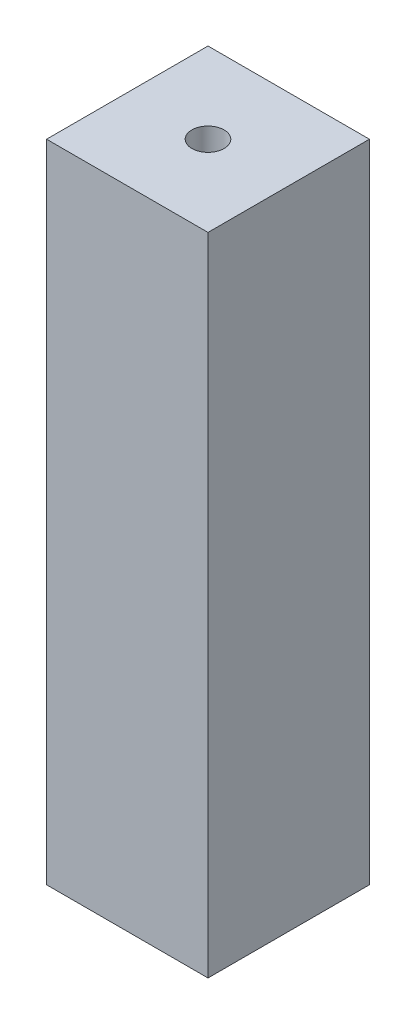
ISO-10303-21;
HEADER;
FILE_DESCRIPTION(('STEP AP214'),'2;1');
FILE_NAME('part.step','',(''),(''),'','','');
FILE_SCHEMA(('AUTOMOTIVE_DESIGN { 1 0 10303 214 1 1 1 1 }'));
ENDSEC;
DATA;
#1=APPLICATION_CONTEXT('core data for automotive mechanical design processes');
#2=APPLICATION_PROTOCOL_DEFINITION('international standard','automotive_design',2000,#1);
#3=PRODUCT_CONTEXT('',#1,'mechanical');
#4=PRODUCT('Part','Part','',(#3));
#5=PRODUCT_RELATED_PRODUCT_CATEGORY('part','',(#4));
#6=PRODUCT_DEFINITION_FORMATION('','',#4);
#7=PRODUCT_DEFINITION_CONTEXT('part definition',#1,'design');
#8=PRODUCT_DEFINITION('design','',#6,#7);
#9=PRODUCT_DEFINITION_SHAPE('','',#8);
#10=(LENGTH_UNIT() NAMED_UNIT(*) SI_UNIT(.MILLI.,.METRE.));
#11=(NAMED_UNIT(*) PLANE_ANGLE_UNIT() SI_UNIT($,.RADIAN.));
#12=(NAMED_UNIT(*) SI_UNIT($,.STERADIAN.) SOLID_ANGLE_UNIT());
#13=UNCERTAINTY_MEASURE_WITH_UNIT(LENGTH_MEASURE(1.E-05),#10,'distance_accuracy_value','');
#14=(GEOMETRIC_REPRESENTATION_CONTEXT(3) GLOBAL_UNCERTAINTY_ASSIGNED_CONTEXT((#13)) GLOBAL_UNIT_ASSIGNED_CONTEXT((#10,
#11,#12)) REPRESENTATION_CONTEXT('',''));
#15=CARTESIAN_POINT('',(0.,0.,0.));
#16=DIRECTION('',(0.,0.,1.));
#17=DIRECTION('',(1.,0.,0.));
#18=AXIS2_PLACEMENT_3D('',#15,#16,#17);
#19=CARTESIAN_POINT('',(0.,60.,0.));
#20=DIRECTION('',(0.,1.,0.));
#21=DIRECTION('',(0.,0.,1.));
#22=AXIS2_PLACEMENT_3D('',#19,#20,#21);
#23=PLANE('',#22);
#24=DIRECTION('',(0.,0.,1.));
#25=VECTOR('',#24,1.);
#26=CARTESIAN_POINT('',(-7.5,60.,-7.5));
#27=LINE('',#26,#25);
#28=CARTESIAN_POINT('',(-7.5,60.,-7.5));
#29=VERTEX_POINT('',#28);
#30=CARTESIAN_POINT('',(-7.5,60.,7.5));
#31=VERTEX_POINT('',#30);
#32=EDGE_CURVE('E98',#29,#31,#27,.T.);
#33=ORIENTED_EDGE('',*,*,#32,.T.);
#34=DIRECTION('',(1.,0.,0.));
#35=VECTOR('',#34,1.);
#36=CARTESIAN_POINT('',(-7.5,60.,7.5));
#37=LINE('',#36,#35);
#38=CARTESIAN_POINT('',(7.5,60.,7.5));
#39=VERTEX_POINT('',#38);
#40=EDGE_CURVE('E93',#31,#39,#37,.T.);
#41=ORIENTED_EDGE('',*,*,#40,.T.);
#42=DIRECTION('',(0.,0.,-1.));
#43=VECTOR('',#42,1.);
#44=CARTESIAN_POINT('',(7.5,60.,-7.5));
#45=LINE('',#44,#43);
#46=CARTESIAN_POINT('',(7.5,60.,-7.5));
#47=VERTEX_POINT('',#46);
#48=EDGE_CURVE('E96',#39,#47,#45,.T.);
#49=ORIENTED_EDGE('',*,*,#48,.T.);
#50=DIRECTION('',(-1.,0.,0.));
#51=VECTOR('',#50,1.);
#52=CARTESIAN_POINT('',(-7.5,60.,-7.5));
#53=LINE('',#52,#51);
#54=EDGE_CURVE('E63',#47,#29,#53,.T.);
#55=ORIENTED_EDGE('',*,*,#54,.T.);
#56=EDGE_LOOP('',(#33,#41,#49,#55));
#57=FACE_BOUND('',#56,.T.);
#58=CARTESIAN_POINT('',(0.,60.,0.));
#59=DIRECTION('',(0.,1.,0.));
#60=DIRECTION('',(0.,0.,1.));
#61=AXIS2_PLACEMENT_3D('',#58,#59,#60);
#62=CIRCLE('',#61,1.5);
#63=CARTESIAN_POINT('',(0.,60.,1.5));
#64=VERTEX_POINT('',#63);
#65=EDGE_CURVE('E118',#64,#64,#62,.T.);
#66=ORIENTED_EDGE('',*,*,#65,.F.);
#67=EDGE_LOOP('',(#66));
#68=FACE_BOUND('',#67,.T.);
#69=ADVANCED_FACE('F45',(#57,#68),#23,.T.);
#70=CARTESIAN_POINT('',(0.,0.,0.));
#71=DIRECTION('',(0.,1.,0.));
#72=DIRECTION('',(0.,0.,1.));
#73=AXIS2_PLACEMENT_3D('',#70,#71,#72);
#74=PLANE('',#73);
#75=DIRECTION('',(0.,0.,1.));
#76=VECTOR('',#75,1.);
#77=CARTESIAN_POINT('',(-7.5,0.,-7.5));
#78=LINE('',#77,#76);
#79=CARTESIAN_POINT('',(-7.5,0.,-7.5));
#80=VERTEX_POINT('',#79);
#81=CARTESIAN_POINT('',(-7.5,0.,7.5));
#82=VERTEX_POINT('',#81);
#83=EDGE_CURVE('E114',#80,#82,#78,.T.);
#84=ORIENTED_EDGE('',*,*,#83,.F.);
#85=DIRECTION('',(-1.,0.,0.));
#86=VECTOR('',#85,1.);
#87=CARTESIAN_POINT('',(-7.5,0.,-7.5));
#88=LINE('',#87,#86);
#89=CARTESIAN_POINT('',(7.5,0.,-7.5));
#90=VERTEX_POINT('',#89);
#91=EDGE_CURVE('E86',#90,#80,#88,.T.);
#92=ORIENTED_EDGE('',*,*,#91,.F.);
#93=DIRECTION('',(0.,0.,-1.));
#94=VECTOR('',#93,1.);
#95=CARTESIAN_POINT('',(7.5,0.,-7.5));
#96=LINE('',#95,#94);
#97=CARTESIAN_POINT('',(7.5,0.,7.5));
#98=VERTEX_POINT('',#97);
#99=EDGE_CURVE('E80',#98,#90,#96,.T.);
#100=ORIENTED_EDGE('',*,*,#99,.F.);
#101=DIRECTION('',(1.,0.,0.));
#102=VECTOR('',#101,1.);
#103=CARTESIAN_POINT('',(-7.5,0.,7.5));
#104=LINE('',#103,#102);
#105=EDGE_CURVE('E103',#82,#98,#104,.T.);
#106=ORIENTED_EDGE('',*,*,#105,.F.);
#107=EDGE_LOOP('',(#84,#92,#100,#106));
#108=FACE_BOUND('',#107,.T.);
#109=CARTESIAN_POINT('',(0.,0.,0.));
#110=DIRECTION('',(0.,1.,0.));
#111=DIRECTION('',(0.,0.,1.));
#112=AXIS2_PLACEMENT_3D('',#109,#110,#111);
#113=CIRCLE('',#112,1.5);
#114=CARTESIAN_POINT('',(0.,0.,1.5));
#115=VERTEX_POINT('',#114);
#116=EDGE_CURVE('E136',#115,#115,#113,.T.);
#117=ORIENTED_EDGE('',*,*,#116,.T.);
#118=EDGE_LOOP('',(#117));
#119=FACE_BOUND('',#118,.T.);
#120=ADVANCED_FACE('F131',(#108,#119),#74,.F.);
#121=CARTESIAN_POINT('',(-7.5,60.,-7.5));
#122=DIRECTION('',(1.,0.,0.));
#123=DIRECTION('',(0.,0.,-1.));
#124=AXIS2_PLACEMENT_3D('',#121,#122,#123);
#125=PLANE('',#124);
#126=ORIENTED_EDGE('',*,*,#83,.T.);
#127=DIRECTION('',(0.,-1.,0.));
#128=VECTOR('',#127,1.);
#129=CARTESIAN_POINT('',(-7.5,60.,7.5));
#130=LINE('',#129,#128);
#131=EDGE_CURVE('E11',#31,#82,#130,.T.);
#132=ORIENTED_EDGE('',*,*,#131,.F.);
#133=ORIENTED_EDGE('',*,*,#32,.F.);
#134=DIRECTION('',(0.,-1.,0.));
#135=VECTOR('',#134,1.);
#136=CARTESIAN_POINT('',(-7.5,60.,-7.5));
#137=LINE('',#136,#135);
#138=EDGE_CURVE('E110',#29,#80,#137,.T.);
#139=ORIENTED_EDGE('',*,*,#138,.T.);
#140=EDGE_LOOP('',(#126,#132,#133,#139));
#141=FACE_BOUND('',#140,.T.);
#142=ADVANCED_FACE('F47',(#141),#125,.F.);
#143=CARTESIAN_POINT('',(-7.5,60.,7.5));
#144=DIRECTION('',(0.,0.,-1.));
#145=DIRECTION('',(-1.,0.,0.));
#146=AXIS2_PLACEMENT_3D('',#143,#144,#145);
#147=PLANE('',#146);
#148=ORIENTED_EDGE('',*,*,#105,.T.);
#149=DIRECTION('',(0.,-1.,0.));
#150=VECTOR('',#149,1.);
#151=CARTESIAN_POINT('',(7.5,60.,7.5));
#152=LINE('',#151,#150);
#153=EDGE_CURVE('E55',#39,#98,#152,.T.);
#154=ORIENTED_EDGE('',*,*,#153,.F.);
#155=ORIENTED_EDGE('',*,*,#40,.F.);
#156=ORIENTED_EDGE('',*,*,#131,.T.);
#157=EDGE_LOOP('',(#148,#154,#155,#156));
#158=FACE_BOUND('',#157,.T.);
#159=ADVANCED_FACE('F102',(#158),#147,.F.);
#160=CARTESIAN_POINT('',(7.5,60.,-7.5));
#161=DIRECTION('',(-1.,0.,0.));
#162=DIRECTION('',(0.,0.,1.));
#163=AXIS2_PLACEMENT_3D('',#160,#161,#162);
#164=PLANE('',#163);
#165=ORIENTED_EDGE('',*,*,#99,.T.);
#166=DIRECTION('',(0.,-1.,0.));
#167=VECTOR('',#166,1.);
#168=CARTESIAN_POINT('',(7.5,60.,-7.5));
#169=LINE('',#168,#167);
#170=EDGE_CURVE('E105',#47,#90,#169,.T.);
#171=ORIENTED_EDGE('',*,*,#170,.F.);
#172=ORIENTED_EDGE('',*,*,#48,.F.);
#173=ORIENTED_EDGE('',*,*,#153,.T.);
#174=EDGE_LOOP('',(#165,#171,#172,#173));
#175=FACE_BOUND('',#174,.T.);
#176=ADVANCED_FACE('F106',(#175),#164,.F.);
#177=CARTESIAN_POINT('',(-7.5,60.,-7.5));
#178=DIRECTION('',(0.,0.,1.));
#179=DIRECTION('',(1.,0.,0.));
#180=AXIS2_PLACEMENT_3D('',#177,#178,#179);
#181=PLANE('',#180);
#182=ORIENTED_EDGE('',*,*,#91,.T.);
#183=ORIENTED_EDGE('',*,*,#138,.F.);
#184=ORIENTED_EDGE('',*,*,#54,.F.);
#185=ORIENTED_EDGE('',*,*,#170,.T.);
#186=EDGE_LOOP('',(#182,#183,#184,#185));
#187=FACE_BOUND('',#186,.T.);
#188=ADVANCED_FACE('F128',(#187),#181,.F.);
#189=CARTESIAN_POINT('',(0.,60.,0.));
#190=DIRECTION('',(0.,-1.,0.));
#191=DIRECTION('',(0.,0.,-1.));
#192=AXIS2_PLACEMENT_3D('',#189,#190,#191);
#193=CYLINDRICAL_SURFACE('',#192,1.5);
#194=ORIENTED_EDGE('',*,*,#65,.T.);
#195=EDGE_LOOP('',(#194));
#196=FACE_BOUND('',#195,.T.);
#197=ORIENTED_EDGE('',*,*,#116,.F.);
#198=EDGE_LOOP('',(#197));
#199=FACE_BOUND('',#198,.T.);
#200=ADVANCED_FACE('F144',(#196,#199),#193,.F.);
#201=CLOSED_SHELL('',(#69,#120,#142,#159,#176,#188,#200));
#202=MANIFOLD_SOLID_BREP('B2',#201);
#203=ADVANCED_BREP_SHAPE_REPRESENTATION('',(#18,#202),#14);
#204=SHAPE_DEFINITION_REPRESENTATION(#9,#203);
ENDSEC;
END-ISO-10303-21;
